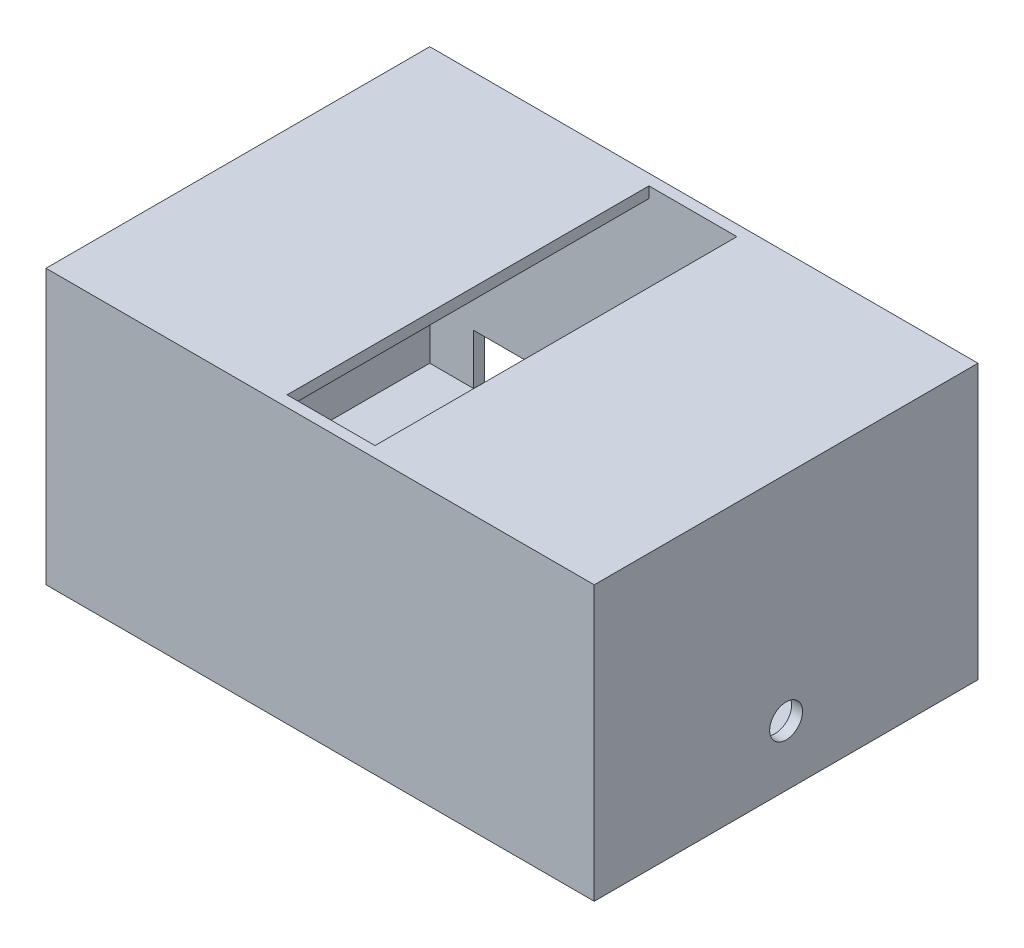
ISO-10303-21;
HEADER;
FILE_DESCRIPTION(('STEP AP214'),'2;1');
FILE_NAME('part.step','',(''),(''),'','','');
FILE_SCHEMA(('AUTOMOTIVE_DESIGN { 1 0 10303 214 1 1 1 1 }'));
ENDSEC;
DATA;
#1=APPLICATION_CONTEXT('core data for automotive mechanical design processes');
#2=APPLICATION_PROTOCOL_DEFINITION('international standard','automotive_design',2000,#1);
#3=PRODUCT_CONTEXT('',#1,'mechanical');
#4=PRODUCT('Part','Part','',(#3));
#5=PRODUCT_RELATED_PRODUCT_CATEGORY('part','',(#4));
#6=PRODUCT_DEFINITION_FORMATION('','',#4);
#7=PRODUCT_DEFINITION_CONTEXT('part definition',#1,'design');
#8=PRODUCT_DEFINITION('design','',#6,#7);
#9=PRODUCT_DEFINITION_SHAPE('','',#8);
#10=(LENGTH_UNIT() NAMED_UNIT(*) SI_UNIT(.MILLI.,.METRE.));
#11=(NAMED_UNIT(*) PLANE_ANGLE_UNIT() SI_UNIT($,.RADIAN.));
#12=(NAMED_UNIT(*) SI_UNIT($,.STERADIAN.) SOLID_ANGLE_UNIT());
#13=UNCERTAINTY_MEASURE_WITH_UNIT(LENGTH_MEASURE(1.E-05),#10,'distance_accuracy_value','');
#14=(GEOMETRIC_REPRESENTATION_CONTEXT(3) GLOBAL_UNCERTAINTY_ASSIGNED_CONTEXT((#13)) GLOBAL_UNIT_ASSIGNED_CONTEXT((#10,
#11,#12)) REPRESENTATION_CONTEXT('',''));
#15=CARTESIAN_POINT('',(0.,0.,0.));
#16=DIRECTION('',(0.,0.,1.));
#17=DIRECTION('',(1.,0.,0.));
#18=AXIS2_PLACEMENT_3D('',#15,#16,#17);
#19=CARTESIAN_POINT('',(120.,291.247317584214,-82.5));
#20=DIRECTION('',(1.,0.,0.));
#21=DIRECTION('',(0.,0.,-1.));
#22=AXIS2_PLACEMENT_3D('',#19,#20,#21);
#23=PLANE('',#22);
#24=CARTESIAN_POINT('',(120.,-97.5,0.));
#25=DIRECTION('',(1.,0.,0.));
#26=DIRECTION('',(0.,0.,-1.));
#27=AXIS2_PLACEMENT_3D('',#24,#25,#26);
#28=CIRCLE('',#27,7.50000000000001);
#29=CARTESIAN_POINT('',(120.,-97.5,-7.5));
#30=VERTEX_POINT('',#29);
#31=EDGE_CURVE('E221',#30,#30,#28,.T.);
#32=ORIENTED_EDGE('',*,*,#31,.T.);
#33=EDGE_LOOP('',(#32));
#34=FACE_BOUND('',#33,.T.);
#35=DIRECTION('',(0.,0.,-1.));
#36=VECTOR('',#35,1.);
#37=CARTESIAN_POINT('',(120.,-120.,-82.5));
#38=LINE('',#37,#36);
#39=CARTESIAN_POINT('',(120.,-120.,82.5));
#40=VERTEX_POINT('',#39);
#41=CARTESIAN_POINT('',(120.,-120.,-82.5));
#42=VERTEX_POINT('',#41);
#43=EDGE_CURVE('E208',#40,#42,#38,.T.);
#44=ORIENTED_EDGE('',*,*,#43,.F.);
#45=DIRECTION('',(0.,-1.,0.));
#46=VECTOR('',#45,1.);
#47=CARTESIAN_POINT('',(120.,291.247317584214,82.5));
#48=LINE('',#47,#46);
#49=CARTESIAN_POINT('',(120.,-5.,82.5));
#50=VERTEX_POINT('',#49);
#51=EDGE_CURVE('E244',#50,#40,#48,.T.);
#52=ORIENTED_EDGE('',*,*,#51,.F.);
#53=DIRECTION('',(0.,0.,-1.));
#54=VECTOR('',#53,1.);
#55=CARTESIAN_POINT('',(120.,-5.,-82.5));
#56=LINE('',#55,#54);
#57=CARTESIAN_POINT('',(120.,-5.,-82.5));
#58=VERTEX_POINT('',#57);
#59=EDGE_CURVE('E263',#50,#58,#56,.T.);
#60=ORIENTED_EDGE('',*,*,#59,.T.);
#61=DIRECTION('',(0.,-1.,0.));
#62=VECTOR('',#61,1.);
#63=CARTESIAN_POINT('',(120.,291.247317584214,-82.5));
#64=LINE('',#63,#62);
#65=EDGE_CURVE('E258',#58,#42,#64,.T.);
#66=ORIENTED_EDGE('',*,*,#65,.T.);
#67=EDGE_LOOP('',(#44,#52,#60,#66));
#68=FACE_BOUND('',#67,.T.);
#69=ADVANCED_FACE('F45',(#34,#68),#23,.F.);
#70=CARTESIAN_POINT('',(-120.,291.247317584214,-82.5));
#71=DIRECTION('',(0.,0.,-1.));
#72=DIRECTION('',(-1.,0.,0.));
#73=AXIS2_PLACEMENT_3D('',#70,#71,#72);
#74=PLANE('',#73);
#75=DIRECTION('',(-1.,0.,0.));
#76=VECTOR('',#75,1.);
#77=CARTESIAN_POINT('',(-120.,-120.,-82.5));
#78=LINE('',#77,#76);
#79=CARTESIAN_POINT('',(-100.,-120.,-82.5));
#80=VERTEX_POINT('',#79);
#81=CARTESIAN_POINT('',(-120.,-120.,-82.5));
#82=VERTEX_POINT('',#81);
#83=EDGE_CURVE('E203',#80,#82,#78,.T.);
#84=ORIENTED_EDGE('',*,*,#83,.F.);
#85=DIRECTION('',(0.,-1.,0.));
#86=VECTOR('',#85,1.);
#87=CARTESIAN_POINT('',(-100.,-120.,-82.5));
#88=LINE('',#87,#86);
#89=CARTESIAN_POINT('',(-100.,-97.,-82.5));
#90=VERTEX_POINT('',#89);
#91=EDGE_CURVE('E199',#90,#80,#88,.T.);
#92=ORIENTED_EDGE('',*,*,#91,.F.);
#93=DIRECTION('',(-1.,0.,0.));
#94=VECTOR('',#93,1.);
#95=CARTESIAN_POINT('',(100.,-97.,-82.5));
#96=LINE('',#95,#94);
#97=CARTESIAN_POINT('',(100.,-97.,-82.5));
#98=VERTEX_POINT('',#97);
#99=EDGE_CURVE('E195',#98,#90,#96,.T.);
#100=ORIENTED_EDGE('',*,*,#99,.F.);
#101=DIRECTION('',(0.,1.,0.));
#102=VECTOR('',#101,1.);
#103=CARTESIAN_POINT('',(100.,-120.,-82.5));
#104=LINE('',#103,#102);
#105=CARTESIAN_POINT('',(100.,-120.,-82.5));
#106=VERTEX_POINT('',#105);
#107=EDGE_CURVE('E167',#106,#98,#104,.T.);
#108=ORIENTED_EDGE('',*,*,#107,.F.);
#109=EDGE_CURVE('E204',#42,#106,#78,.T.);
#110=ORIENTED_EDGE('',*,*,#109,.F.);
#111=ORIENTED_EDGE('',*,*,#65,.F.);
#112=DIRECTION('',(-1.,0.,0.));
#113=VECTOR('',#112,1.);
#114=CARTESIAN_POINT('',(-120.,-5.,-82.5));
#115=LINE('',#114,#113);
#116=CARTESIAN_POINT('',(20.05,-5.,-82.5));
#117=VERTEX_POINT('',#116);
#118=EDGE_CURVE('E259',#58,#117,#115,.T.);
#119=ORIENTED_EDGE('',*,*,#118,.T.);
#120=DIRECTION('',(0.,1.,0.));
#121=VECTOR('',#120,1.);
#122=CARTESIAN_POINT('',(20.05,-125.,-82.5));
#123=LINE('',#122,#121);
#124=CARTESIAN_POINT('',(20.05,0.,-82.5));
#125=VERTEX_POINT('',#124);
#126=EDGE_CURVE('E240',#117,#125,#123,.T.);
#127=ORIENTED_EDGE('',*,*,#126,.T.);
#128=DIRECTION('',(-1.,0.,0.));
#129=VECTOR('',#128,1.);
#130=CARTESIAN_POINT('',(-20.05,0.,-82.5));
#131=LINE('',#130,#129);
#132=CARTESIAN_POINT('',(-20.05,0.,-82.5));
#133=VERTEX_POINT('',#132);
#134=EDGE_CURVE('E228',#125,#133,#131,.T.);
#135=ORIENTED_EDGE('',*,*,#134,.T.);
#136=DIRECTION('',(0.,1.,0.));
#137=VECTOR('',#136,1.);
#138=CARTESIAN_POINT('',(-20.05,-125.,-82.5));
#139=LINE('',#138,#137);
#140=CARTESIAN_POINT('',(-20.05,-5.,-82.5));
#141=VERTEX_POINT('',#140);
#142=EDGE_CURVE('E248',#141,#133,#139,.T.);
#143=ORIENTED_EDGE('',*,*,#142,.F.);
#144=CARTESIAN_POINT('',(-120.,-5.,-82.5));
#145=VERTEX_POINT('',#144);
#146=EDGE_CURVE('E257',#141,#145,#115,.T.);
#147=ORIENTED_EDGE('',*,*,#146,.T.);
#148=DIRECTION('',(0.,-1.,0.));
#149=VECTOR('',#148,1.);
#150=CARTESIAN_POINT('',(-120.,291.247317584214,-82.5));
#151=LINE('',#150,#149);
#152=EDGE_CURVE('E270',#145,#82,#151,.T.);
#153=ORIENTED_EDGE('',*,*,#152,.T.);
#154=EDGE_LOOP('',(#84,#92,#100,#108,#110,#111,#119,#127,#135,#143,#147,#153));
#155=FACE_BOUND('',#154,.T.);
#156=ADVANCED_FACE('F357',(#155),#74,.F.);
#157=CARTESIAN_POINT('',(-120.,291.247317584214,-82.5));
#158=DIRECTION('',(-1.,0.,0.));
#159=DIRECTION('',(0.,0.,1.));
#160=AXIS2_PLACEMENT_3D('',#157,#158,#159);
#161=PLANE('',#160);
#162=CARTESIAN_POINT('',(-120.,-97.5,0.));
#163=DIRECTION('',(-1.,0.,0.));
#164=DIRECTION('',(0.,0.,1.));
#165=AXIS2_PLACEMENT_3D('',#162,#163,#164);
#166=CIRCLE('',#165,7.50000000000001);
#167=CARTESIAN_POINT('',(-120.,-97.5,7.50000000000002));
#168=VERTEX_POINT('',#167);
#169=EDGE_CURVE('E217',#168,#168,#166,.T.);
#170=ORIENTED_EDGE('',*,*,#169,.T.);
#171=EDGE_LOOP('',(#170));
#172=FACE_BOUND('',#171,.T.);
#173=DIRECTION('',(0.,0.,1.));
#174=VECTOR('',#173,1.);
#175=CARTESIAN_POINT('',(-120.,-120.,-82.5));
#176=LINE('',#175,#174);
#177=CARTESIAN_POINT('',(-120.,-120.,82.5));
#178=VERTEX_POINT('',#177);
#179=EDGE_CURVE('E198',#82,#178,#176,.T.);
#180=ORIENTED_EDGE('',*,*,#179,.F.);
#181=ORIENTED_EDGE('',*,*,#152,.F.);
#182=DIRECTION('',(0.,0.,1.));
#183=VECTOR('',#182,1.);
#184=CARTESIAN_POINT('',(-120.,-5.,-82.5));
#185=LINE('',#184,#183);
#186=CARTESIAN_POINT('',(-120.,-5.,82.5));
#187=VERTEX_POINT('',#186);
#188=EDGE_CURVE('E254',#145,#187,#185,.T.);
#189=ORIENTED_EDGE('',*,*,#188,.T.);
#190=DIRECTION('',(0.,-1.,0.));
#191=VECTOR('',#190,1.);
#192=CARTESIAN_POINT('',(-120.,291.247317584214,82.5));
#193=LINE('',#192,#191);
#194=EDGE_CURVE('E274',#187,#178,#193,.T.);
#195=ORIENTED_EDGE('',*,*,#194,.T.);
#196=EDGE_LOOP('',(#180,#181,#189,#195));
#197=FACE_BOUND('',#196,.T.);
#198=ADVANCED_FACE('F337',(#172,#197),#161,.F.);
#199=CARTESIAN_POINT('',(-120.,291.247317584214,82.5));
#200=DIRECTION('',(0.,0.,1.));
#201=DIRECTION('',(1.,0.,0.));
#202=AXIS2_PLACEMENT_3D('',#199,#200,#201);
#203=PLANE('',#202);
#204=DIRECTION('',(1.,0.,0.));
#205=VECTOR('',#204,1.);
#206=CARTESIAN_POINT('',(-120.,-120.,82.5));
#207=LINE('',#206,#205);
#208=EDGE_CURVE('E12',#178,#40,#207,.T.);
#209=ORIENTED_EDGE('',*,*,#208,.F.);
#210=ORIENTED_EDGE('',*,*,#194,.F.);
#211=DIRECTION('',(1.,0.,0.));
#212=VECTOR('',#211,1.);
#213=CARTESIAN_POINT('',(-120.,-5.,82.5));
#214=LINE('',#213,#212);
#215=CARTESIAN_POINT('',(-20.05,-5.,82.5));
#216=VERTEX_POINT('',#215);
#217=EDGE_CURVE('E280',#187,#216,#214,.T.);
#218=ORIENTED_EDGE('',*,*,#217,.T.);
#219=DIRECTION('',(0.,1.,0.));
#220=VECTOR('',#219,1.);
#221=CARTESIAN_POINT('',(-20.05,-125.,82.5));
#222=LINE('',#221,#220);
#223=CARTESIAN_POINT('',(-20.05,0.,82.5));
#224=VERTEX_POINT('',#223);
#225=EDGE_CURVE('E245',#216,#224,#222,.T.);
#226=ORIENTED_EDGE('',*,*,#225,.T.);
#227=DIRECTION('',(1.,0.,0.));
#228=VECTOR('',#227,1.);
#229=CARTESIAN_POINT('',(-20.05,0.,82.5));
#230=LINE('',#229,#228);
#231=CARTESIAN_POINT('',(20.05,0.,82.5));
#232=VERTEX_POINT('',#231);
#233=EDGE_CURVE('E236',#224,#232,#230,.T.);
#234=ORIENTED_EDGE('',*,*,#233,.T.);
#235=DIRECTION('',(0.,1.,0.));
#236=VECTOR('',#235,1.);
#237=CARTESIAN_POINT('',(20.05,-125.,82.5));
#238=LINE('',#237,#236);
#239=CARTESIAN_POINT('',(20.05,-5.,82.5));
#240=VERTEX_POINT('',#239);
#241=EDGE_CURVE('E241',#240,#232,#238,.T.);
#242=ORIENTED_EDGE('',*,*,#241,.F.);
#243=EDGE_CURVE('E266',#240,#50,#214,.T.);
#244=ORIENTED_EDGE('',*,*,#243,.T.);
#245=ORIENTED_EDGE('',*,*,#51,.T.);
#246=EDGE_LOOP('',(#209,#210,#218,#226,#234,#242,#244,#245));
#247=FACE_BOUND('',#246,.T.);
#248=ADVANCED_FACE('F368',(#247),#203,.F.);
#249=CARTESIAN_POINT('',(0.,-5.,0.));
#250=DIRECTION('',(0.,-1.,0.));
#251=DIRECTION('',(0.,0.,-1.));
#252=AXIS2_PLACEMENT_3D('',#249,#250,#251);
#253=PLANE('',#252);
#254=DIRECTION('',(0.,0.,1.));
#255=VECTOR('',#254,1.);
#256=CARTESIAN_POINT('',(20.05,-5.,0.));
#257=LINE('',#256,#255);
#258=EDGE_CURVE('E54',#117,#240,#257,.T.);
#259=ORIENTED_EDGE('',*,*,#258,.F.);
#260=ORIENTED_EDGE('',*,*,#118,.F.);
#261=ORIENTED_EDGE('',*,*,#59,.F.);
#262=ORIENTED_EDGE('',*,*,#243,.F.);
#263=EDGE_LOOP('',(#259,#260,#261,#262));
#264=FACE_BOUND('',#263,.T.);
#265=ADVANCED_FACE('F402',(#264),#253,.T.);
#266=CARTESIAN_POINT('',(-125.,-125.,87.5));
#267=DIRECTION('',(-1.,0.,0.));
#268=DIRECTION('',(0.,0.,1.));
#269=AXIS2_PLACEMENT_3D('',#266,#267,#268);
#270=PLANE('',#269);
#271=DIRECTION('',(0.,1.,0.));
#272=VECTOR('',#271,1.);
#273=CARTESIAN_POINT('',(-125.,-125.,87.5));
#274=LINE('',#273,#272);
#275=CARTESIAN_POINT('',(-125.,-125.,87.5));
#276=VERTEX_POINT('',#275);
#277=CARTESIAN_POINT('',(-125.,0.,87.5));
#278=VERTEX_POINT('',#277);
#279=EDGE_CURVE('E302',#276,#278,#274,.T.);
#280=ORIENTED_EDGE('',*,*,#279,.T.);
#281=DIRECTION('',(0.,0.,1.));
#282=VECTOR('',#281,1.);
#283=CARTESIAN_POINT('',(-125.,0.,87.5));
#284=LINE('',#283,#282);
#285=CARTESIAN_POINT('',(-125.,0.,-87.5));
#286=VERTEX_POINT('',#285);
#287=EDGE_CURVE('E284',#286,#278,#284,.T.);
#288=ORIENTED_EDGE('',*,*,#287,.F.);
#289=DIRECTION('',(0.,1.,0.));
#290=VECTOR('',#289,1.);
#291=CARTESIAN_POINT('',(-125.,-125.,-87.5));
#292=LINE('',#291,#290);
#293=CARTESIAN_POINT('',(-125.,-125.,-87.5));
#294=VERTEX_POINT('',#293);
#295=EDGE_CURVE('E317',#294,#286,#292,.T.);
#296=ORIENTED_EDGE('',*,*,#295,.F.);
#297=DIRECTION('',(0.,0.,1.));
#298=VECTOR('',#297,1.);
#299=CARTESIAN_POINT('',(-125.,-125.,87.5));
#300=LINE('',#299,#298);
#301=EDGE_CURVE('E285',#294,#276,#300,.T.);
#302=ORIENTED_EDGE('',*,*,#301,.T.);
#303=EDGE_LOOP('',(#280,#288,#296,#302));
#304=FACE_BOUND('',#303,.T.);
#305=CARTESIAN_POINT('',(-125.,-97.5,0.));
#306=DIRECTION('',(-1.,0.,0.));
#307=DIRECTION('',(0.,0.,1.));
#308=AXIS2_PLACEMENT_3D('',#305,#306,#307);
#309=CIRCLE('',#308,7.50000000000001);
#310=CARTESIAN_POINT('',(-125.,-97.5,7.50000000000002));
#311=VERTEX_POINT('',#310);
#312=EDGE_CURVE('E212',#311,#311,#309,.T.);
#313=ORIENTED_EDGE('',*,*,#312,.F.);
#314=EDGE_LOOP('',(#313));
#315=FACE_BOUND('',#314,.T.);
#316=ADVANCED_FACE('F47',(#304,#315),#270,.T.);
#317=CARTESIAN_POINT('',(-125.,-125.,-87.5));
#318=DIRECTION('',(0.,0.,-1.));
#319=DIRECTION('',(-1.,0.,0.));
#320=AXIS2_PLACEMENT_3D('',#317,#318,#319);
#321=PLANE('',#320);
#322=DIRECTION('',(0.,1.,0.));
#323=VECTOR('',#322,1.);
#324=CARTESIAN_POINT('',(-100.,-120.,-87.5));
#325=LINE('',#324,#323);
#326=CARTESIAN_POINT('',(-100.,-120.,-87.5));
#327=VERTEX_POINT('',#326);
#328=CARTESIAN_POINT('',(-100.,-97.,-87.5));
#329=VERTEX_POINT('',#328);
#330=EDGE_CURVE('E61',#327,#329,#325,.T.);
#331=ORIENTED_EDGE('',*,*,#330,.F.);
#332=DIRECTION('',(-1.,0.,0.));
#333=VECTOR('',#332,1.);
#334=CARTESIAN_POINT('',(100.,-120.,-87.5));
#335=LINE('',#334,#333);
#336=CARTESIAN_POINT('',(100.,-120.,-87.5));
#337=VERTEX_POINT('',#336);
#338=EDGE_CURVE('E182',#337,#327,#335,.T.);
#339=ORIENTED_EDGE('',*,*,#338,.F.);
#340=DIRECTION('',(0.,-1.,0.));
#341=VECTOR('',#340,1.);
#342=CARTESIAN_POINT('',(100.,-120.,-87.5));
#343=LINE('',#342,#341);
#344=CARTESIAN_POINT('',(100.,-97.,-87.5));
#345=VERTEX_POINT('',#344);
#346=EDGE_CURVE('E164',#345,#337,#343,.T.);
#347=ORIENTED_EDGE('',*,*,#346,.F.);
#348=DIRECTION('',(1.,0.,0.));
#349=VECTOR('',#348,1.);
#350=CARTESIAN_POINT('',(100.,-97.,-87.5));
#351=LINE('',#350,#349);
#352=EDGE_CURVE('E175',#329,#345,#351,.T.);
#353=ORIENTED_EDGE('',*,*,#352,.F.);
#354=EDGE_LOOP('',(#331,#339,#347,#353));
#355=FACE_BOUND('',#354,.T.);
#356=ORIENTED_EDGE('',*,*,#295,.T.);
#357=DIRECTION('',(-1.,0.,0.));
#358=VECTOR('',#357,1.);
#359=CARTESIAN_POINT('',(-125.,0.,-87.5));
#360=LINE('',#359,#358);
#361=CARTESIAN_POINT('',(125.,0.,-87.5));
#362=VERTEX_POINT('',#361);
#363=EDGE_CURVE('E290',#362,#286,#360,.T.);
#364=ORIENTED_EDGE('',*,*,#363,.F.);
#365=DIRECTION('',(0.,1.,0.));
#366=VECTOR('',#365,1.);
#367=CARTESIAN_POINT('',(125.,-125.,-87.5));
#368=LINE('',#367,#366);
#369=CARTESIAN_POINT('',(125.,-125.,-87.5));
#370=VERTEX_POINT('',#369);
#371=EDGE_CURVE('E321',#370,#362,#368,.T.);
#372=ORIENTED_EDGE('',*,*,#371,.F.);
#373=DIRECTION('',(-1.,0.,0.));
#374=VECTOR('',#373,1.);
#375=CARTESIAN_POINT('',(-125.,-125.,-87.5));
#376=LINE('',#375,#374);
#377=EDGE_CURVE('E298',#370,#294,#376,.T.);
#378=ORIENTED_EDGE('',*,*,#377,.T.);
#379=EDGE_LOOP('',(#356,#364,#372,#378));
#380=FACE_BOUND('',#379,.T.);
#381=ADVANCED_FACE('F180',(#355,#380),#321,.T.);
#382=CARTESIAN_POINT('',(125.,-125.,87.5));
#383=DIRECTION('',(1.,0.,0.));
#384=DIRECTION('',(0.,0.,-1.));
#385=AXIS2_PLACEMENT_3D('',#382,#383,#384);
#386=PLANE('',#385);
#387=ORIENTED_EDGE('',*,*,#371,.T.);
#388=DIRECTION('',(0.,0.,-1.));
#389=VECTOR('',#388,1.);
#390=CARTESIAN_POINT('',(125.,0.,87.5));
#391=LINE('',#390,#389);
#392=CARTESIAN_POINT('',(125.,0.,87.5));
#393=VERTEX_POINT('',#392);
#394=EDGE_CURVE('E310',#393,#362,#391,.T.);
#395=ORIENTED_EDGE('',*,*,#394,.F.);
#396=DIRECTION('',(0.,1.,0.));
#397=VECTOR('',#396,1.);
#398=CARTESIAN_POINT('',(125.,-125.,87.5));
#399=LINE('',#398,#397);
#400=CARTESIAN_POINT('',(125.,-125.,87.5));
#401=VERTEX_POINT('',#400);
#402=EDGE_CURVE('E324',#401,#393,#399,.T.);
#403=ORIENTED_EDGE('',*,*,#402,.F.);
#404=DIRECTION('',(0.,0.,-1.));
#405=VECTOR('',#404,1.);
#406=CARTESIAN_POINT('',(125.,-125.,87.5));
#407=LINE('',#406,#405);
#408=EDGE_CURVE('E294',#401,#370,#407,.T.);
#409=ORIENTED_EDGE('',*,*,#408,.T.);
#410=EDGE_LOOP('',(#387,#395,#403,#409));
#411=FACE_BOUND('',#410,.T.);
#412=CARTESIAN_POINT('',(125.,-97.5,0.));
#413=DIRECTION('',(-1.,0.,0.));
#414=DIRECTION('',(0.,0.,1.));
#415=AXIS2_PLACEMENT_3D('',#412,#413,#414);
#416=CIRCLE('',#415,7.50000000000001);
#417=CARTESIAN_POINT('',(125.,-97.5,7.50000000000002));
#418=VERTEX_POINT('',#417);
#419=EDGE_CURVE('E213',#418,#418,#416,.T.);
#420=ORIENTED_EDGE('',*,*,#419,.T.);
#421=EDGE_LOOP('',(#420));
#422=FACE_BOUND('',#421,.T.);
#423=ADVANCED_FACE('F382',(#411,#422),#386,.T.);
#424=CARTESIAN_POINT('',(-125.,-125.,87.5));
#425=DIRECTION('',(0.,0.,1.));
#426=DIRECTION('',(1.,0.,0.));
#427=AXIS2_PLACEMENT_3D('',#424,#425,#426);
#428=PLANE('',#427);
#429=ORIENTED_EDGE('',*,*,#402,.T.);
#430=DIRECTION('',(1.,0.,0.));
#431=VECTOR('',#430,1.);
#432=CARTESIAN_POINT('',(-125.,0.,87.5));
#433=LINE('',#432,#431);
#434=EDGE_CURVE('E306',#278,#393,#433,.T.);
#435=ORIENTED_EDGE('',*,*,#434,.F.);
#436=ORIENTED_EDGE('',*,*,#279,.F.);
#437=DIRECTION('',(1.,0.,0.));
#438=VECTOR('',#437,1.);
#439=CARTESIAN_POINT('',(-125.,-125.,87.5));
#440=LINE('',#439,#438);
#441=EDGE_CURVE('E289',#276,#401,#440,.T.);
#442=ORIENTED_EDGE('',*,*,#441,.T.);
#443=EDGE_LOOP('',(#429,#435,#436,#442));
#444=FACE_BOUND('',#443,.T.);
#445=ADVANCED_FACE('F374',(#444),#428,.T.);
#446=CARTESIAN_POINT('',(0.,-125.,0.));
#447=DIRECTION('',(0.,-1.,0.));
#448=DIRECTION('',(0.,0.,-1.));
#449=AXIS2_PLACEMENT_3D('',#446,#447,#448);
#450=PLANE('',#449);
#451=ORIENTED_EDGE('',*,*,#301,.F.);
#452=ORIENTED_EDGE('',*,*,#377,.F.);
#453=ORIENTED_EDGE('',*,*,#408,.F.);
#454=ORIENTED_EDGE('',*,*,#441,.F.);
#455=EDGE_LOOP('',(#451,#452,#453,#454));
#456=FACE_BOUND('',#455,.T.);
#457=ADVANCED_FACE('F370',(#456),#450,.T.);
#458=CARTESIAN_POINT('',(0.,0.,0.));
#459=DIRECTION('',(0.,-1.,0.));
#460=DIRECTION('',(0.,0.,-1.));
#461=AXIS2_PLACEMENT_3D('',#458,#459,#460);
#462=PLANE('',#461);
#463=ORIENTED_EDGE('',*,*,#134,.F.);
#464=DIRECTION('',(0.,0.,-1.));
#465=VECTOR('',#464,1.);
#466=CARTESIAN_POINT('',(20.05,0.,82.5));
#467=LINE('',#466,#465);
#468=EDGE_CURVE('E225',#232,#125,#467,.T.);
#469=ORIENTED_EDGE('',*,*,#468,.F.);
#470=ORIENTED_EDGE('',*,*,#233,.F.);
#471=DIRECTION('',(0.,0.,1.));
#472=VECTOR('',#471,1.);
#473=CARTESIAN_POINT('',(-20.05,0.,82.5));
#474=LINE('',#473,#472);
#475=EDGE_CURVE('E232',#133,#224,#474,.T.);
#476=ORIENTED_EDGE('',*,*,#475,.F.);
#477=EDGE_LOOP('',(#463,#469,#470,#476));
#478=FACE_BOUND('',#477,.T.);
#479=ORIENTED_EDGE('',*,*,#287,.T.);
#480=ORIENTED_EDGE('',*,*,#434,.T.);
#481=ORIENTED_EDGE('',*,*,#394,.T.);
#482=ORIENTED_EDGE('',*,*,#363,.T.);
#483=EDGE_LOOP('',(#479,#480,#481,#482));
#484=FACE_BOUND('',#483,.T.);
#485=ADVANCED_FACE('F373',(#478,#484),#462,.F.);
#486=DIRECTION('',(0.,0.,-1.));
#487=VECTOR('',#486,1.);
#488=CARTESIAN_POINT('',(-20.05,-5.,0.));
#489=LINE('',#488,#487);
#490=EDGE_CURVE('E320',#216,#141,#489,.T.);
#491=ORIENTED_EDGE('',*,*,#490,.F.);
#492=ORIENTED_EDGE('',*,*,#217,.F.);
#493=ORIENTED_EDGE('',*,*,#188,.F.);
#494=ORIENTED_EDGE('',*,*,#146,.F.);
#495=EDGE_LOOP('',(#491,#492,#493,#494));
#496=FACE_BOUND('',#495,.T.);
#497=ADVANCED_FACE('F378',(#496),#253,.T.);
#498=CARTESIAN_POINT('',(20.05,-125.,82.5));
#499=DIRECTION('',(1.,0.,0.));
#500=DIRECTION('',(0.,0.,-1.));
#501=AXIS2_PLACEMENT_3D('',#498,#499,#500);
#502=PLANE('',#501);
#503=ORIENTED_EDGE('',*,*,#258,.T.);
#504=ORIENTED_EDGE('',*,*,#241,.T.);
#505=ORIENTED_EDGE('',*,*,#468,.T.);
#506=ORIENTED_EDGE('',*,*,#126,.F.);
#507=EDGE_LOOP('',(#503,#504,#505,#506));
#508=FACE_BOUND('',#507,.T.);
#509=ADVANCED_FACE('F352',(#508),#502,.F.);
#510=CARTESIAN_POINT('',(-20.05,-125.,82.5));
#511=DIRECTION('',(-1.,0.,0.));
#512=DIRECTION('',(0.,0.,1.));
#513=AXIS2_PLACEMENT_3D('',#510,#511,#512);
#514=PLANE('',#513);
#515=ORIENTED_EDGE('',*,*,#490,.T.);
#516=ORIENTED_EDGE('',*,*,#142,.T.);
#517=ORIENTED_EDGE('',*,*,#475,.T.);
#518=ORIENTED_EDGE('',*,*,#225,.F.);
#519=EDGE_LOOP('',(#515,#516,#517,#518));
#520=FACE_BOUND('',#519,.T.);
#521=ADVANCED_FACE('F343',(#520),#514,.F.);
#522=CARTESIAN_POINT('',(125.,-97.5,0.));
#523=DIRECTION('',(-1.,0.,0.));
#524=DIRECTION('',(0.,0.,1.));
#525=AXIS2_PLACEMENT_3D('',#522,#523,#524);
#526=CYLINDRICAL_SURFACE('',#525,7.50000000000001);
#527=ORIENTED_EDGE('',*,*,#312,.T.);
#528=EDGE_LOOP('',(#527));
#529=FACE_BOUND('',#528,.T.);
#530=ORIENTED_EDGE('',*,*,#169,.F.);
#531=EDGE_LOOP('',(#530));
#532=FACE_BOUND('',#531,.T.);
#533=ADVANCED_FACE('F340',(#529,#532),#526,.F.);
#534=ORIENTED_EDGE('',*,*,#419,.F.);
#535=EDGE_LOOP('',(#534));
#536=FACE_BOUND('',#535,.T.);
#537=ORIENTED_EDGE('',*,*,#31,.F.);
#538=EDGE_LOOP('',(#537));
#539=FACE_BOUND('',#538,.T.);
#540=ADVANCED_FACE('F342',(#536,#539),#526,.F.);
#541=CARTESIAN_POINT('',(0.,-120.,0.));
#542=DIRECTION('',(0.,-1.,0.));
#543=DIRECTION('',(0.,0.,-1.));
#544=AXIS2_PLACEMENT_3D('',#541,#542,#543);
#545=PLANE('',#544);
#546=ORIENTED_EDGE('',*,*,#208,.T.);
#547=ORIENTED_EDGE('',*,*,#43,.T.);
#548=ORIENTED_EDGE('',*,*,#109,.T.);
#549=DIRECTION('',(0.,0.,-1.));
#550=VECTOR('',#549,1.);
#551=CARTESIAN_POINT('',(100.,-120.,118.818156160839));
#552=LINE('',#551,#550);
#553=EDGE_CURVE('E171',#106,#337,#552,.T.);
#554=ORIENTED_EDGE('',*,*,#553,.T.);
#555=ORIENTED_EDGE('',*,*,#338,.T.);
#556=DIRECTION('',(0.,0.,-1.));
#557=VECTOR('',#556,1.);
#558=CARTESIAN_POINT('',(-100.,-120.,118.818156160839));
#559=LINE('',#558,#557);
#560=EDGE_CURVE('E68',#80,#327,#559,.T.);
#561=ORIENTED_EDGE('',*,*,#560,.F.);
#562=ORIENTED_EDGE('',*,*,#83,.T.);
#563=ORIENTED_EDGE('',*,*,#179,.T.);
#564=EDGE_LOOP('',(#546,#547,#548,#554,#555,#561,#562,#563));
#565=FACE_BOUND('',#564,.T.);
#566=ADVANCED_FACE('F350',(#565),#545,.F.);
#567=CARTESIAN_POINT('',(-100.,-120.,118.818156160839));
#568=DIRECTION('',(-1.,0.,0.));
#569=DIRECTION('',(0.,0.,1.));
#570=AXIS2_PLACEMENT_3D('',#567,#568,#569);
#571=PLANE('',#570);
#572=ORIENTED_EDGE('',*,*,#91,.T.);
#573=ORIENTED_EDGE('',*,*,#560,.T.);
#574=ORIENTED_EDGE('',*,*,#330,.T.);
#575=DIRECTION('',(0.,0.,-1.));
#576=VECTOR('',#575,1.);
#577=CARTESIAN_POINT('',(-100.,-97.,118.818156160839));
#578=LINE('',#577,#576);
#579=EDGE_CURVE('E172',#90,#329,#578,.T.);
#580=ORIENTED_EDGE('',*,*,#579,.F.);
#581=EDGE_LOOP('',(#572,#573,#574,#580));
#582=FACE_BOUND('',#581,.T.);
#583=ADVANCED_FACE('F436',(#582),#571,.F.);
#584=CARTESIAN_POINT('',(100.,-120.,118.818156160839));
#585=DIRECTION('',(1.,0.,0.));
#586=DIRECTION('',(0.,0.,-1.));
#587=AXIS2_PLACEMENT_3D('',#584,#585,#586);
#588=PLANE('',#587);
#589=ORIENTED_EDGE('',*,*,#107,.T.);
#590=DIRECTION('',(0.,0.,-1.));
#591=VECTOR('',#590,1.);
#592=CARTESIAN_POINT('',(100.,-97.,118.818156160839));
#593=LINE('',#592,#591);
#594=EDGE_CURVE('E160',#98,#345,#593,.T.);
#595=ORIENTED_EDGE('',*,*,#594,.T.);
#596=ORIENTED_EDGE('',*,*,#346,.T.);
#597=ORIENTED_EDGE('',*,*,#553,.F.);
#598=EDGE_LOOP('',(#589,#595,#596,#597));
#599=FACE_BOUND('',#598,.T.);
#600=ADVANCED_FACE('F162',(#599),#588,.F.);
#601=CARTESIAN_POINT('',(100.,-97.,118.818156160839));
#602=DIRECTION('',(0.,1.,0.));
#603=DIRECTION('',(0.,0.,1.));
#604=AXIS2_PLACEMENT_3D('',#601,#602,#603);
#605=PLANE('',#604);
#606=ORIENTED_EDGE('',*,*,#99,.T.);
#607=ORIENTED_EDGE('',*,*,#579,.T.);
#608=ORIENTED_EDGE('',*,*,#352,.T.);
#609=ORIENTED_EDGE('',*,*,#594,.F.);
#610=EDGE_LOOP('',(#606,#607,#608,#609));
#611=FACE_BOUND('',#610,.T.);
#612=ADVANCED_FACE('F176',(#611),#605,.F.);
#613=CLOSED_SHELL('',(#69,#156,#198,#248,#265,#316,#381,#423,#445,#457,#485,#497,#509,#521,#533,
#540,#566,#583,#600,#612));
#614=MANIFOLD_SOLID_BREP('B2',#613);
#615=ADVANCED_BREP_SHAPE_REPRESENTATION('',(#18,#614),#14);
#616=SHAPE_DEFINITION_REPRESENTATION(#9,#615);
ENDSEC;
END-ISO-10303-21;
